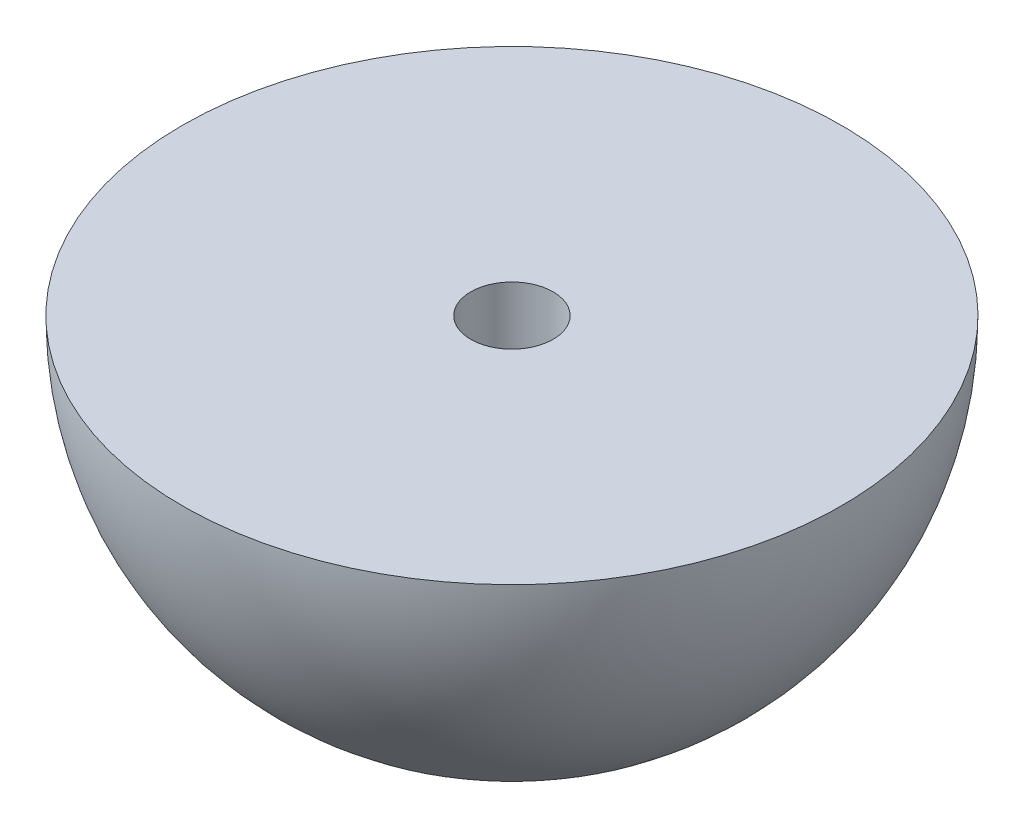
ISO-10303-21;
HEADER;
FILE_DESCRIPTION(('STEP AP214'),'2;1');
FILE_NAME('part.step','',(''),(''),'','','');
FILE_SCHEMA(('AUTOMOTIVE_DESIGN { 1 0 10303 214 1 1 1 1 }'));
ENDSEC;
DATA;
#1=APPLICATION_CONTEXT('core data for automotive mechanical design processes');
#2=APPLICATION_PROTOCOL_DEFINITION('international standard','automotive_design',2000,#1);
#3=PRODUCT_CONTEXT('',#1,'mechanical');
#4=PRODUCT('Part','Part','',(#3));
#5=PRODUCT_RELATED_PRODUCT_CATEGORY('part','',(#4));
#6=PRODUCT_DEFINITION_FORMATION('','',#4);
#7=PRODUCT_DEFINITION_CONTEXT('part definition',#1,'design');
#8=PRODUCT_DEFINITION('design','',#6,#7);
#9=PRODUCT_DEFINITION_SHAPE('','',#8);
#10=(LENGTH_UNIT() NAMED_UNIT(*) SI_UNIT(.MILLI.,.METRE.));
#11=(NAMED_UNIT(*) PLANE_ANGLE_UNIT() SI_UNIT($,.RADIAN.));
#12=(NAMED_UNIT(*) SI_UNIT($,.STERADIAN.) SOLID_ANGLE_UNIT());
#13=UNCERTAINTY_MEASURE_WITH_UNIT(LENGTH_MEASURE(1.E-05),#10,'distance_accuracy_value','');
#14=(GEOMETRIC_REPRESENTATION_CONTEXT(3) GLOBAL_UNCERTAINTY_ASSIGNED_CONTEXT((#13)) GLOBAL_UNIT_ASSIGNED_CONTEXT((#10,
#11,#12)) REPRESENTATION_CONTEXT('',''));
#15=CARTESIAN_POINT('',(0.,0.,0.));
#16=DIRECTION('',(0.,0.,1.));
#17=DIRECTION('',(1.,0.,0.));
#18=AXIS2_PLACEMENT_3D('',#15,#16,#17);
#19=CARTESIAN_POINT('',(0.,0.,0.));
#20=DIRECTION('',(0.,1.,0.));
#21=DIRECTION('',(-1.,0.,0.));
#22=AXIS2_PLACEMENT_3D('',#19,#20,#21);
#23=SPHERICAL_SURFACE('',#22,8.);
#24=CARTESIAN_POINT('',(1.25514625240658,0.,1.57996293787851));
#25=DIRECTION('',(0.62202491562171,0.,0.782997448492526));
#26=DIRECTION('',(0.782997448492526,0.,-0.62202491562171));
#27=AXIS2_PLACEMENT_3D('',#24,#25,#26);
#28=CIRCLE('',#27,7.74133870851806);
#29=CARTESIAN_POINT('',(2.16733827990038,-7.65317581138706,0.855303911179223));
#30=VERTEX_POINT('',#29);
#31=CARTESIAN_POINT('',(0.342954224912793,-7.65317581138706,2.30462196457781));
#32=VERTEX_POINT('',#31);
#33=EDGE_CURVE('E11',#30,#32,#28,.F.);
#34=ORIENTED_EDGE('',*,*,#33,.F.);
#35=CARTESIAN_POINT('',(1.99586116744398,0.,-0.29700707110968));
#36=DIRECTION('',(0.989108139303779,0.,-0.14719065446901));
#37=DIRECTION('',(-0.14719065446901,0.,-0.989108139303779));
#38=AXIS2_PLACEMENT_3D('',#35,#36,#37);
#39=CIRCLE('',#38,7.74133870851806);
#40=CARTESIAN_POINT('',(1.82438405498758,-7.65317581138706,-1.44931805339858));
#41=VERTEX_POINT('',#40);
#42=EDGE_CURVE('E86',#41,#30,#39,.F.);
#43=ORIENTED_EDGE('',*,*,#42,.F.);
#44=CARTESIAN_POINT('',(0.740714915037396,0.,-1.8769700089882));
#45=DIRECTION('',(0.36708322368207,0.,-0.930188102961535));
#46=DIRECTION('',(-0.930188102961535,0.,-0.36708322368207));
#47=AXIS2_PLACEMENT_3D('',#44,#45,#46);
#48=CIRCLE('',#47,7.74133870851806);
#49=CARTESIAN_POINT('',(-0.342954224912791,-7.65317581138706,-2.30462196457781));
#50=VERTEX_POINT('',#49);
#51=EDGE_CURVE('E132',#50,#41,#48,.F.);
#52=ORIENTED_EDGE('',*,*,#51,.F.);
#53=CARTESIAN_POINT('',(-1.25514625240658,0.,-1.57996293787851));
#54=DIRECTION('',(-0.622024915621709,0.,-0.782997448492526));
#55=DIRECTION('',(-0.782997448492526,0.,0.622024915621709));
#56=AXIS2_PLACEMENT_3D('',#53,#54,#55);
#57=CIRCLE('',#56,7.74133870851806);
#58=CARTESIAN_POINT('',(-2.16733827990038,-7.65317581138706,-0.855303911179223));
#59=VERTEX_POINT('',#58);
#60=EDGE_CURVE('E134',#59,#50,#57,.F.);
#61=ORIENTED_EDGE('',*,*,#60,.F.);
#62=CARTESIAN_POINT('',(-1.99586116744398,0.,0.29700707110968));
#63=DIRECTION('',(-0.989108139303779,0.,0.14719065446901));
#64=DIRECTION('',(0.14719065446901,0.,0.989108139303779));
#65=AXIS2_PLACEMENT_3D('',#62,#63,#64);
#66=CIRCLE('',#65,7.74133870851806);
#67=CARTESIAN_POINT('',(-1.82438405498758,-7.65317581138706,1.44931805339858));
#68=VERTEX_POINT('',#67);
#69=EDGE_CURVE('E136',#68,#59,#66,.F.);
#70=ORIENTED_EDGE('',*,*,#69,.F.);
#71=CARTESIAN_POINT('',(-0.740714915037397,0.,1.87697000898819));
#72=DIRECTION('',(-0.36708322368207,0.,0.930188102961535));
#73=DIRECTION('',(0.930188102961535,0.,0.36708322368207));
#74=AXIS2_PLACEMENT_3D('',#71,#72,#73);
#75=CIRCLE('',#74,7.74133870851806);
#76=EDGE_CURVE('E40',#32,#68,#75,.F.);
#77=ORIENTED_EDGE('',*,*,#76,.F.);
#78=EDGE_LOOP('',(#34,#43,#52,#61,#70,#77));
#79=FACE_BOUND('',#78,.T.);
#80=CARTESIAN_POINT('',(0.,0.,0.));
#81=DIRECTION('',(0.,1.,0.));
#82=DIRECTION('',(-1.,0.,0.));
#83=AXIS2_PLACEMENT_3D('',#80,#81,#82);
#84=CIRCLE('',#83,8.);
#85=CARTESIAN_POINT('',(-8.,0.,0.));
#86=VERTEX_POINT('',#85);
#87=EDGE_CURVE('E126',#86,#86,#84,.T.);
#88=ORIENTED_EDGE('',*,*,#87,.F.);
#89=EDGE_LOOP('',(#88));
#90=FACE_BOUND('',#89,.T.);
#91=ADVANCED_FACE('F33',(#79,#90),#23,.T.);
#92=CARTESIAN_POINT('',(-8.,0.,0.));
#93=DIRECTION('',(0.,1.,0.));
#94=DIRECTION('',(-1.,0.,0.));
#95=AXIS2_PLACEMENT_3D('',#92,#93,#94);
#96=PLANE('',#95);
#97=CARTESIAN_POINT('',(0.,0.,0.));
#98=DIRECTION('',(0.,1.,0.));
#99=DIRECTION('',(-1.,0.,0.));
#100=AXIS2_PLACEMENT_3D('',#97,#98,#99);
#101=CIRCLE('',#100,1.);
#102=CARTESIAN_POINT('',(-1.,0.,0.));
#103=VERTEX_POINT('',#102);
#104=EDGE_CURVE('E123',#103,#103,#101,.T.);
#105=ORIENTED_EDGE('',*,*,#104,.F.);
#106=EDGE_LOOP('',(#105));
#107=FACE_BOUND('',#106,.T.);
#108=ORIENTED_EDGE('',*,*,#87,.T.);
#109=EDGE_LOOP('',(#108));
#110=FACE_BOUND('',#109,.T.);
#111=ADVANCED_FACE('F164',(#107,#110),#96,.T.);
#112=CARTESIAN_POINT('',(0.,-8.,0.));
#113=DIRECTION('',(0.,1.,0.));
#114=DIRECTION('',(-1.,0.,0.));
#115=AXIS2_PLACEMENT_3D('',#112,#113,#114);
#116=CYLINDRICAL_SURFACE('',#115,1.);
#117=CARTESIAN_POINT('',(0.,-3.,0.));
#118=DIRECTION('',(0.,1.,0.));
#119=DIRECTION('',(-1.,0.,0.));
#120=AXIS2_PLACEMENT_3D('',#117,#118,#119);
#121=CIRCLE('',#120,1.);
#122=CARTESIAN_POINT('',(-1.,-3.,0.));
#123=VERTEX_POINT('',#122);
#124=EDGE_CURVE('E115',#123,#123,#121,.F.);
#125=ORIENTED_EDGE('',*,*,#124,.T.);
#126=EDGE_LOOP('',(#125));
#127=FACE_BOUND('',#126,.T.);
#128=ORIENTED_EDGE('',*,*,#104,.T.);
#129=EDGE_LOOP('',(#128));
#130=FACE_BOUND('',#129,.T.);
#131=ADVANCED_FACE('F168',(#127,#130),#116,.F.);
#132=CARTESIAN_POINT('',(0.,-3.,0.));
#133=DIRECTION('',(0.,1.,0.));
#134=DIRECTION('',(-1.,0.,0.));
#135=AXIS2_PLACEMENT_3D('',#132,#133,#134);
#136=PLANE('',#135);
#137=DIRECTION('',(0.782997448492525,0.,-0.622024915621709));
#138=VECTOR('',#137,1.);
#139=CARTESIAN_POINT('',(0.342954224912792,-3.,2.30462196457781));
#140=LINE('',#139,#138);
#141=CARTESIAN_POINT('',(0.342954224912792,-3.,2.30462196457781));
#142=VERTEX_POINT('',#141);
#143=CARTESIAN_POINT('',(2.16733827990038,-3.,0.855303911179223));
#144=VERTEX_POINT('',#143);
#145=EDGE_CURVE('E96',#142,#144,#140,.T.);
#146=ORIENTED_EDGE('',*,*,#145,.F.);
#147=DIRECTION('',(0.930188102961535,0.,0.36708322368207));
#148=VECTOR('',#147,1.);
#149=CARTESIAN_POINT('',(-1.82438405498758,-3.,1.44931805339858));
#150=LINE('',#149,#148);
#151=CARTESIAN_POINT('',(-1.82438405498758,-3.,1.44931805339858));
#152=VERTEX_POINT('',#151);
#153=EDGE_CURVE('E88',#152,#142,#150,.T.);
#154=ORIENTED_EDGE('',*,*,#153,.F.);
#155=DIRECTION('',(0.14719065446901,0.,0.989108139303779));
#156=VECTOR('',#155,1.);
#157=CARTESIAN_POINT('',(-2.16733827990038,-3.,-0.855303911179223));
#158=LINE('',#157,#156);
#159=CARTESIAN_POINT('',(-2.16733827990038,-3.,-0.855303911179223));
#160=VERTEX_POINT('',#159);
#161=EDGE_CURVE('E110',#160,#152,#158,.T.);
#162=ORIENTED_EDGE('',*,*,#161,.F.);
#163=DIRECTION('',(-0.782997448492526,0.,0.622024915621709));
#164=VECTOR('',#163,1.);
#165=CARTESIAN_POINT('',(-0.342954224912792,-3.,-2.30462196457781));
#166=LINE('',#165,#164);
#167=CARTESIAN_POINT('',(-0.342954224912792,-3.,-2.30462196457781));
#168=VERTEX_POINT('',#167);
#169=EDGE_CURVE('E107',#168,#160,#166,.T.);
#170=ORIENTED_EDGE('',*,*,#169,.F.);
#171=DIRECTION('',(-0.930188102961535,0.,-0.36708322368207));
#172=VECTOR('',#171,1.);
#173=CARTESIAN_POINT('',(1.82438405498758,-3.,-1.44931805339858));
#174=LINE('',#173,#172);
#175=CARTESIAN_POINT('',(1.82438405498758,-3.,-1.44931805339858));
#176=VERTEX_POINT('',#175);
#177=EDGE_CURVE('E100',#176,#168,#174,.T.);
#178=ORIENTED_EDGE('',*,*,#177,.F.);
#179=DIRECTION('',(-0.14719065446901,0.,-0.989108139303779));
#180=VECTOR('',#179,1.);
#181=CARTESIAN_POINT('',(2.16733827990038,-3.,0.855303911179223));
#182=LINE('',#181,#180);
#183=EDGE_CURVE('E84',#144,#176,#182,.T.);
#184=ORIENTED_EDGE('',*,*,#183,.F.);
#185=EDGE_LOOP('',(#146,#154,#162,#170,#178,#184));
#186=FACE_BOUND('',#185,.T.);
#187=ORIENTED_EDGE('',*,*,#124,.F.);
#188=EDGE_LOOP('',(#187));
#189=FACE_BOUND('',#188,.T.);
#190=ADVANCED_FACE('F93',(#186,#189),#136,.F.);
#191=CARTESIAN_POINT('',(0.342954224912792,-7.93725393319377,2.30462196457781));
#192=DIRECTION('',(0.62202491562171,0.,0.782997448492526));
#193=DIRECTION('',(0.782997448492526,0.,-0.62202491562171));
#194=AXIS2_PLACEMENT_3D('',#191,#192,#193);
#195=PLANE('',#194);
#196=ORIENTED_EDGE('',*,*,#33,.T.);
#197=DIRECTION('',(0.,1.,0.));
#198=VECTOR('',#197,1.);
#199=CARTESIAN_POINT('',(0.342954224912792,-7.93725393319377,2.30462196457781));
#200=LINE('',#199,#198);
#201=EDGE_CURVE('E103',#32,#142,#200,.T.);
#202=ORIENTED_EDGE('',*,*,#201,.T.);
#203=ORIENTED_EDGE('',*,*,#145,.T.);
#204=DIRECTION('',(0.,1.,0.));
#205=VECTOR('',#204,1.);
#206=CARTESIAN_POINT('',(2.16733827990038,-7.93725393319377,0.855303911179223));
#207=LINE('',#206,#205);
#208=EDGE_CURVE('E81',#30,#144,#207,.T.);
#209=ORIENTED_EDGE('',*,*,#208,.F.);
#210=EDGE_LOOP('',(#196,#202,#203,#209));
#211=FACE_BOUND('',#210,.T.);
#212=ADVANCED_FACE('F102',(#211),#195,.F.);
#213=CARTESIAN_POINT('',(-1.82438405498758,-7.93725393319377,1.44931805339858));
#214=DIRECTION('',(-0.36708322368207,0.,0.930188102961535));
#215=DIRECTION('',(0.930188102961535,0.,0.36708322368207));
#216=AXIS2_PLACEMENT_3D('',#213,#214,#215);
#217=PLANE('',#216);
#218=ORIENTED_EDGE('',*,*,#76,.T.);
#219=DIRECTION('',(0.,1.,0.));
#220=VECTOR('',#219,1.);
#221=CARTESIAN_POINT('',(-1.82438405498758,-7.93725393319377,1.44931805339858));
#222=LINE('',#221,#220);
#223=EDGE_CURVE('E116',#68,#152,#222,.T.);
#224=ORIENTED_EDGE('',*,*,#223,.T.);
#225=ORIENTED_EDGE('',*,*,#153,.T.);
#226=ORIENTED_EDGE('',*,*,#201,.F.);
#227=EDGE_LOOP('',(#218,#224,#225,#226));
#228=FACE_BOUND('',#227,.T.);
#229=ADVANCED_FACE('F140',(#228),#217,.F.);
#230=CARTESIAN_POINT('',(-2.16733827990038,-7.93725393319377,-0.855303911179223));
#231=DIRECTION('',(-0.989108139303779,0.,0.14719065446901));
#232=DIRECTION('',(0.14719065446901,0.,0.989108139303779));
#233=AXIS2_PLACEMENT_3D('',#230,#231,#232);
#234=PLANE('',#233);
#235=ORIENTED_EDGE('',*,*,#69,.T.);
#236=DIRECTION('',(0.,1.,0.));
#237=VECTOR('',#236,1.);
#238=CARTESIAN_POINT('',(-2.16733827990038,-7.93725393319377,-0.855303911179223));
#239=LINE('',#238,#237);
#240=EDGE_CURVE('E118',#59,#160,#239,.T.);
#241=ORIENTED_EDGE('',*,*,#240,.T.);
#242=ORIENTED_EDGE('',*,*,#161,.T.);
#243=ORIENTED_EDGE('',*,*,#223,.F.);
#244=EDGE_LOOP('',(#235,#241,#242,#243));
#245=FACE_BOUND('',#244,.T.);
#246=ADVANCED_FACE('F144',(#245),#234,.F.);
#247=CARTESIAN_POINT('',(-0.342954224912791,-7.93725393319377,-2.30462196457781));
#248=DIRECTION('',(-0.622024915621709,0.,-0.782997448492526));
#249=DIRECTION('',(-0.782997448492526,0.,0.622024915621709));
#250=AXIS2_PLACEMENT_3D('',#247,#248,#249);
#251=PLANE('',#250);
#252=ORIENTED_EDGE('',*,*,#60,.T.);
#253=DIRECTION('',(0.,1.,0.));
#254=VECTOR('',#253,1.);
#255=CARTESIAN_POINT('',(-0.342954224912791,-7.93725393319377,-2.30462196457781));
#256=LINE('',#255,#254);
#257=EDGE_CURVE('E120',#50,#168,#256,.T.);
#258=ORIENTED_EDGE('',*,*,#257,.T.);
#259=ORIENTED_EDGE('',*,*,#169,.T.);
#260=ORIENTED_EDGE('',*,*,#240,.F.);
#261=EDGE_LOOP('',(#252,#258,#259,#260));
#262=FACE_BOUND('',#261,.T.);
#263=ADVANCED_FACE('F152',(#262),#251,.F.);
#264=CARTESIAN_POINT('',(1.82438405498759,-7.93725393319377,-1.44931805339858));
#265=DIRECTION('',(0.36708322368207,0.,-0.930188102961535));
#266=DIRECTION('',(-0.930188102961535,0.,-0.36708322368207));
#267=AXIS2_PLACEMENT_3D('',#264,#265,#266);
#268=PLANE('',#267);
#269=ORIENTED_EDGE('',*,*,#51,.T.);
#270=DIRECTION('',(0.,1.,0.));
#271=VECTOR('',#270,1.);
#272=CARTESIAN_POINT('',(1.82438405498759,-7.93725393319377,-1.44931805339858));
#273=LINE('',#272,#271);
#274=EDGE_CURVE('E47',#41,#176,#273,.T.);
#275=ORIENTED_EDGE('',*,*,#274,.T.);
#276=ORIENTED_EDGE('',*,*,#177,.T.);
#277=ORIENTED_EDGE('',*,*,#257,.F.);
#278=EDGE_LOOP('',(#269,#275,#276,#277));
#279=FACE_BOUND('',#278,.T.);
#280=ADVANCED_FACE('F154',(#279),#268,.F.);
#281=CARTESIAN_POINT('',(2.16733827990038,-7.93725393319377,0.855303911179223));
#282=DIRECTION('',(0.989108139303779,0.,-0.14719065446901));
#283=DIRECTION('',(-0.14719065446901,0.,-0.989108139303779));
#284=AXIS2_PLACEMENT_3D('',#281,#282,#283);
#285=PLANE('',#284);
#286=ORIENTED_EDGE('',*,*,#42,.T.);
#287=ORIENTED_EDGE('',*,*,#208,.T.);
#288=ORIENTED_EDGE('',*,*,#183,.T.);
#289=ORIENTED_EDGE('',*,*,#274,.F.);
#290=EDGE_LOOP('',(#286,#287,#288,#289));
#291=FACE_BOUND('',#290,.T.);
#292=ADVANCED_FACE('F83',(#291),#285,.F.);
#293=CLOSED_SHELL('',(#91,#111,#131,#190,#212,#229,#246,#263,#280,#292));
#294=MANIFOLD_SOLID_BREP('B2',#293);
#295=ADVANCED_BREP_SHAPE_REPRESENTATION('',(#18,#294),#14);
#296=SHAPE_DEFINITION_REPRESENTATION(#9,#295);
ENDSEC;
END-ISO-10303-21;
